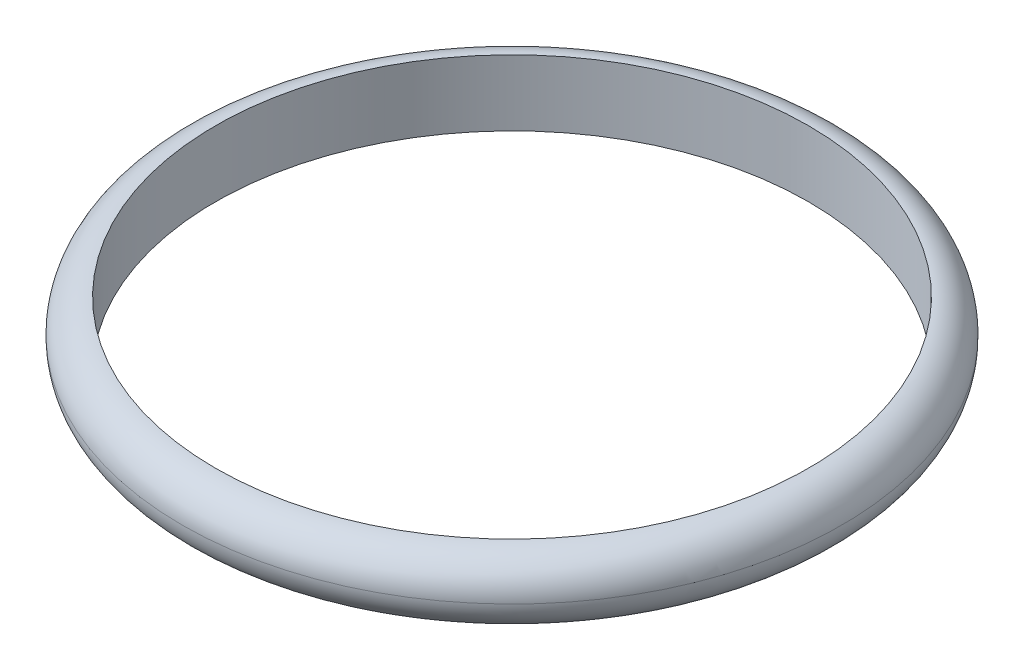
ISO-10303-21;
HEADER;
FILE_DESCRIPTION(('STEP AP214'),'2;1');
FILE_NAME('part.step','',(''),(''),'','','');
FILE_SCHEMA(('AUTOMOTIVE_DESIGN { 1 0 10303 214 1 1 1 1 }'));
ENDSEC;
DATA;
#1=APPLICATION_CONTEXT('core data for automotive mechanical design processes');
#2=APPLICATION_PROTOCOL_DEFINITION('international standard','automotive_design',2000,#1);
#3=PRODUCT_CONTEXT('',#1,'mechanical');
#4=PRODUCT('Part','Part','',(#3));
#5=PRODUCT_RELATED_PRODUCT_CATEGORY('part','',(#4));
#6=PRODUCT_DEFINITION_FORMATION('','',#4);
#7=PRODUCT_DEFINITION_CONTEXT('part definition',#1,'design');
#8=PRODUCT_DEFINITION('design','',#6,#7);
#9=PRODUCT_DEFINITION_SHAPE('','',#8);
#10=(LENGTH_UNIT() NAMED_UNIT(*) SI_UNIT(.MILLI.,.METRE.));
#11=(NAMED_UNIT(*) PLANE_ANGLE_UNIT() SI_UNIT($,.RADIAN.));
#12=(NAMED_UNIT(*) SI_UNIT($,.STERADIAN.) SOLID_ANGLE_UNIT());
#13=UNCERTAINTY_MEASURE_WITH_UNIT(LENGTH_MEASURE(1.E-05),#10,'distance_accuracy_value','');
#14=(GEOMETRIC_REPRESENTATION_CONTEXT(3) GLOBAL_UNCERTAINTY_ASSIGNED_CONTEXT((#13)) GLOBAL_UNIT_ASSIGNED_CONTEXT((#10,
#11,#12)) REPRESENTATION_CONTEXT('',''));
#15=CARTESIAN_POINT('',(0.,0.,0.));
#16=DIRECTION('',(0.,0.,1.));
#17=DIRECTION('',(1.,0.,0.));
#18=AXIS2_PLACEMENT_3D('',#15,#16,#17);
#19=CARTESIAN_POINT('',(0.,4.,0.));
#20=DIRECTION('',(0.,-1.,0.));
#21=DIRECTION('',(0.,0.,-1.));
#22=AXIS2_PLACEMENT_3D('',#19,#20,#21);
#23=CYLINDRICAL_SURFACE('',#22,18.);
#24=CARTESIAN_POINT('',(0.,4.,0.));
#25=DIRECTION('',(0.,1.,0.));
#26=DIRECTION('',(0.,0.,1.));
#27=AXIS2_PLACEMENT_3D('',#24,#25,#26);
#28=CIRCLE('',#27,18.);
#29=CARTESIAN_POINT('',(0.,4.,18.));
#30=VERTEX_POINT('',#29);
#31=EDGE_CURVE('E10',#30,#30,#28,.T.);
#32=ORIENTED_EDGE('',*,*,#31,.T.);
#33=EDGE_LOOP('',(#32));
#34=FACE_BOUND('',#33,.T.);
#35=CARTESIAN_POINT('',(0.,0.,0.));
#36=DIRECTION('',(0.,1.,0.));
#37=DIRECTION('',(0.,0.,1.));
#38=AXIS2_PLACEMENT_3D('',#35,#36,#37);
#39=CIRCLE('',#38,18.);
#40=CARTESIAN_POINT('',(0.,0.,18.));
#41=VERTEX_POINT('',#40);
#42=EDGE_CURVE('E36',#41,#41,#39,.T.);
#43=ORIENTED_EDGE('',*,*,#42,.F.);
#44=EDGE_LOOP('',(#43));
#45=FACE_BOUND('',#44,.T.);
#46=ADVANCED_FACE('F28',(#34,#45),#23,.F.);
#47=CARTESIAN_POINT('',(0.,2.,0.));
#48=DIRECTION('',(0.,1.,0.));
#49=DIRECTION('',(0.,0.,1.));
#50=AXIS2_PLACEMENT_3D('',#47,#48,#49);
#51=TOROIDAL_SURFACE('',#50,18.,2.);
#52=ORIENTED_EDGE('',*,*,#31,.F.);
#53=EDGE_LOOP('',(#52));
#54=FACE_BOUND('',#53,.T.);
#55=CARTESIAN_POINT('',(0.,2.,0.));
#56=DIRECTION('',(0.,1.,0.));
#57=DIRECTION('',(0.,0.,1.));
#58=AXIS2_PLACEMENT_3D('',#55,#56,#57);
#59=CIRCLE('',#58,20.);
#60=CARTESIAN_POINT('',(0.,2.,20.));
#61=VERTEX_POINT('',#60);
#62=EDGE_CURVE('E32',#61,#61,#59,.F.);
#63=ORIENTED_EDGE('',*,*,#62,.F.);
#64=EDGE_LOOP('',(#63));
#65=FACE_BOUND('',#64,.T.);
#66=ADVANCED_FACE('F30',(#54,#65),#51,.T.);
#67=CARTESIAN_POINT('',(0.,2.,0.));
#68=DIRECTION('',(0.,1.,0.));
#69=DIRECTION('',(0.,0.,1.));
#70=AXIS2_PLACEMENT_3D('',#67,#68,#69);
#71=TOROIDAL_SURFACE('',#70,18.,2.);
#72=ORIENTED_EDGE('',*,*,#42,.T.);
#73=EDGE_LOOP('',(#72));
#74=FACE_BOUND('',#73,.T.);
#75=ORIENTED_EDGE('',*,*,#62,.T.);
#76=EDGE_LOOP('',(#75));
#77=FACE_BOUND('',#76,.T.);
#78=ADVANCED_FACE('F46',(#74,#77),#71,.T.);
#79=CLOSED_SHELL('',(#46,#66,#78));
#80=MANIFOLD_SOLID_BREP('B2',#79);
#81=ADVANCED_BREP_SHAPE_REPRESENTATION('',(#18,#80),#14);
#82=SHAPE_DEFINITION_REPRESENTATION(#9,#81);
ENDSEC;
END-ISO-10303-21;
